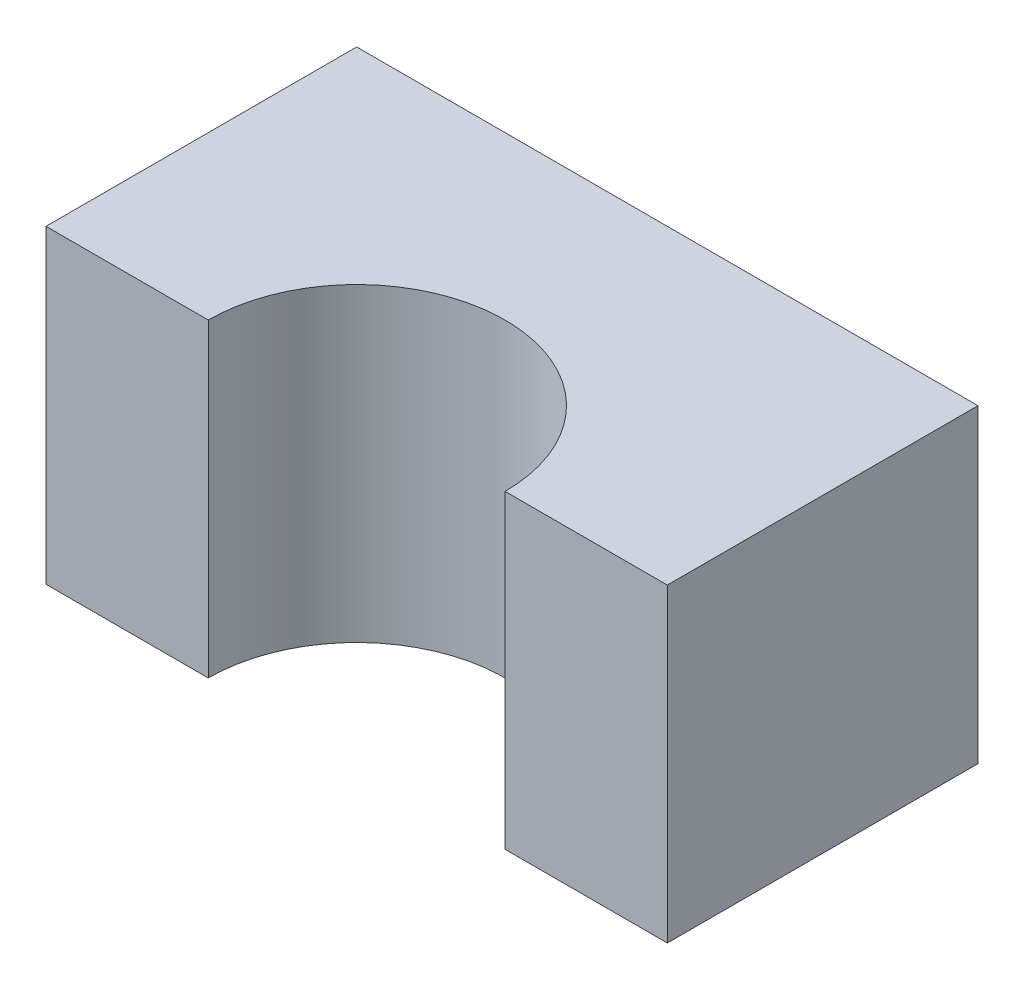
ISO-10303-21;
HEADER;
FILE_DESCRIPTION(('STEP AP214'),'2;1');
FILE_NAME('part.step','',(''),(''),'','','');
FILE_SCHEMA(('AUTOMOTIVE_DESIGN { 1 0 10303 214 1 1 1 1 }'));
ENDSEC;
DATA;
#1=APPLICATION_CONTEXT('core data for automotive mechanical design processes');
#2=APPLICATION_PROTOCOL_DEFINITION('international standard','automotive_design',2000,#1);
#3=PRODUCT_CONTEXT('',#1,'mechanical');
#4=PRODUCT('Part','Part','',(#3));
#5=PRODUCT_RELATED_PRODUCT_CATEGORY('part','',(#4));
#6=PRODUCT_DEFINITION_FORMATION('','',#4);
#7=PRODUCT_DEFINITION_CONTEXT('part definition',#1,'design');
#8=PRODUCT_DEFINITION('design','',#6,#7);
#9=PRODUCT_DEFINITION_SHAPE('','',#8);
#10=(LENGTH_UNIT() NAMED_UNIT(*) SI_UNIT(.MILLI.,.METRE.));
#11=(NAMED_UNIT(*) PLANE_ANGLE_UNIT() SI_UNIT($,.RADIAN.));
#12=(NAMED_UNIT(*) SI_UNIT($,.STERADIAN.) SOLID_ANGLE_UNIT());
#13=UNCERTAINTY_MEASURE_WITH_UNIT(LENGTH_MEASURE(1.E-05),#10,'distance_accuracy_value','');
#14=(GEOMETRIC_REPRESENTATION_CONTEXT(3) GLOBAL_UNCERTAINTY_ASSIGNED_CONTEXT((#13)) GLOBAL_UNIT_ASSIGNED_CONTEXT((#10,
#11,#12)) REPRESENTATION_CONTEXT('',''));
#15=CARTESIAN_POINT('',(0.,0.,0.));
#16=DIRECTION('',(0.,0.,1.));
#17=DIRECTION('',(1.,0.,0.));
#18=AXIS2_PLACEMENT_3D('',#15,#16,#17);
#19=CARTESIAN_POINT('',(0.,0.,0.));
#20=DIRECTION('',(0.,0.,1.));
#21=DIRECTION('',(1.,0.,0.));
#22=AXIS2_PLACEMENT_3D('',#19,#20,#21);
#23=PLANE('',#22);
#24=DIRECTION('',(0.,1.,0.));
#25=VECTOR('',#24,1.);
#26=CARTESIAN_POINT('',(19.05,-19.8975467775468,0.));
#27=LINE('',#26,#25);
#28=CARTESIAN_POINT('',(19.05,-19.8975467775468,0.));
#29=VERTEX_POINT('',#28);
#30=CARTESIAN_POINT('',(19.05,19.8975467775468,0.));
#31=VERTEX_POINT('',#30);
#32=EDGE_CURVE('E11',#29,#31,#27,.T.);
#33=ORIENTED_EDGE('',*,*,#32,.F.);
#34=DIRECTION('',(1.,0.,0.));
#35=VECTOR('',#34,1.);
#36=CARTESIAN_POINT('',(-39.878,-19.8975467775468,0.));
#37=LINE('',#36,#35);
#38=CARTESIAN_POINT('',(39.878,-19.8975467775468,0.));
#39=VERTEX_POINT('',#38);
#40=EDGE_CURVE('E86',#29,#39,#37,.T.);
#41=ORIENTED_EDGE('',*,*,#40,.T.);
#42=DIRECTION('',(0.,1.,0.));
#43=VECTOR('',#42,1.);
#44=CARTESIAN_POINT('',(39.878,19.8975467775468,0.));
#45=LINE('',#44,#43);
#46=CARTESIAN_POINT('',(39.878,19.8975467775468,0.));
#47=VERTEX_POINT('',#46);
#48=EDGE_CURVE('E112',#39,#47,#45,.T.);
#49=ORIENTED_EDGE('',*,*,#48,.T.);
#50=DIRECTION('',(-1.,0.,0.));
#51=VECTOR('',#50,1.);
#52=CARTESIAN_POINT('',(-39.878,19.8975467775468,0.));
#53=LINE('',#52,#51);
#54=EDGE_CURVE('E107',#47,#31,#53,.T.);
#55=ORIENTED_EDGE('',*,*,#54,.T.);
#56=EDGE_LOOP('',(#33,#41,#49,#55));
#57=FACE_BOUND('',#56,.T.);
#58=ADVANCED_FACE('F39',(#57),#23,.T.);
#59=CARTESIAN_POINT('',(39.878,19.8975467775468,-39.878));
#60=DIRECTION('',(1.,0.,0.));
#61=DIRECTION('',(0.,0.,-1.));
#62=AXIS2_PLACEMENT_3D('',#59,#60,#61);
#63=PLANE('',#62);
#64=ORIENTED_EDGE('',*,*,#48,.F.);
#65=DIRECTION('',(0.,0.,1.));
#66=VECTOR('',#65,1.);
#67=CARTESIAN_POINT('',(39.878,-19.8975467775468,-39.878));
#68=LINE('',#67,#66);
#69=CARTESIAN_POINT('',(39.878,-19.8975467775468,-39.878));
#70=VERTEX_POINT('',#69);
#71=EDGE_CURVE('E63',#70,#39,#68,.T.);
#72=ORIENTED_EDGE('',*,*,#71,.F.);
#73=DIRECTION('',(0.,1.,0.));
#74=VECTOR('',#73,1.);
#75=CARTESIAN_POINT('',(39.878,19.8975467775468,-39.878));
#76=LINE('',#75,#74);
#77=CARTESIAN_POINT('',(39.878,19.8975467775468,-39.878));
#78=VERTEX_POINT('',#77);
#79=EDGE_CURVE('E127',#70,#78,#76,.T.);
#80=ORIENTED_EDGE('',*,*,#79,.T.);
#81=DIRECTION('',(0.,0.,1.));
#82=VECTOR('',#81,1.);
#83=CARTESIAN_POINT('',(39.878,19.8975467775468,-39.878));
#84=LINE('',#83,#82);
#85=EDGE_CURVE('E92',#78,#47,#84,.T.);
#86=ORIENTED_EDGE('',*,*,#85,.T.);
#87=EDGE_LOOP('',(#64,#72,#80,#86));
#88=FACE_BOUND('',#87,.T.);
#89=ADVANCED_FACE('F41',(#88),#63,.T.);
#90=CARTESIAN_POINT('',(-39.878,-19.8975467775468,-39.878));
#91=DIRECTION('',(0.,-1.,0.));
#92=DIRECTION('',(0.,0.,-1.));
#93=AXIS2_PLACEMENT_3D('',#90,#91,#92);
#94=PLANE('',#93);
#95=CARTESIAN_POINT('',(0.,-19.8975467775468,0.));
#96=DIRECTION('',(0.,1.,0.));
#97=DIRECTION('',(0.,0.,1.));
#98=AXIS2_PLACEMENT_3D('',#95,#96,#97);
#99=CIRCLE('',#98,19.05);
#100=CARTESIAN_POINT('',(-19.05,-19.8975467775468,0.));
#101=VERTEX_POINT('',#100);
#102=EDGE_CURVE('E103',#29,#101,#99,.T.);
#103=ORIENTED_EDGE('',*,*,#102,.T.);
#104=CARTESIAN_POINT('',(-39.878,-19.8975467775468,0.));
#105=VERTEX_POINT('',#104);
#106=EDGE_CURVE('E123',#105,#101,#37,.T.);
#107=ORIENTED_EDGE('',*,*,#106,.F.);
#108=DIRECTION('',(0.,0.,1.));
#109=VECTOR('',#108,1.);
#110=CARTESIAN_POINT('',(-39.878,-19.8975467775468,-39.878));
#111=LINE('',#110,#109);
#112=CARTESIAN_POINT('',(-39.878,-19.8975467775468,-39.878));
#113=VERTEX_POINT('',#112);
#114=EDGE_CURVE('E130',#113,#105,#111,.T.);
#115=ORIENTED_EDGE('',*,*,#114,.F.);
#116=DIRECTION('',(1.,0.,0.));
#117=VECTOR('',#116,1.);
#118=CARTESIAN_POINT('',(-39.878,-19.8975467775468,-39.878));
#119=LINE('',#118,#117);
#120=EDGE_CURVE('E137',#113,#70,#119,.T.);
#121=ORIENTED_EDGE('',*,*,#120,.T.);
#122=ORIENTED_EDGE('',*,*,#71,.T.);
#123=ORIENTED_EDGE('',*,*,#40,.F.);
#124=EDGE_LOOP('',(#103,#107,#115,#121,#122,#123));
#125=FACE_BOUND('',#124,.T.);
#126=ADVANCED_FACE('F142',(#125),#94,.T.);
#127=CARTESIAN_POINT('',(-39.878,19.8975467775468,-39.878));
#128=DIRECTION('',(-1.,0.,0.));
#129=DIRECTION('',(0.,0.,1.));
#130=AXIS2_PLACEMENT_3D('',#127,#128,#129);
#131=PLANE('',#130);
#132=DIRECTION('',(0.,-1.,0.));
#133=VECTOR('',#132,1.);
#134=CARTESIAN_POINT('',(-39.878,19.8975467775468,0.));
#135=LINE('',#134,#133);
#136=CARTESIAN_POINT('',(-39.878,19.8975467775468,0.));
#137=VERTEX_POINT('',#136);
#138=EDGE_CURVE('E114',#137,#105,#135,.T.);
#139=ORIENTED_EDGE('',*,*,#138,.F.);
#140=DIRECTION('',(0.,0.,1.));
#141=VECTOR('',#140,1.);
#142=CARTESIAN_POINT('',(-39.878,19.8975467775468,-39.878));
#143=LINE('',#142,#141);
#144=CARTESIAN_POINT('',(-39.878,19.8975467775468,-39.878));
#145=VERTEX_POINT('',#144);
#146=EDGE_CURVE('E133',#145,#137,#143,.T.);
#147=ORIENTED_EDGE('',*,*,#146,.F.);
#148=DIRECTION('',(0.,-1.,0.));
#149=VECTOR('',#148,1.);
#150=CARTESIAN_POINT('',(-39.878,19.8975467775468,-39.878));
#151=LINE('',#150,#149);
#152=EDGE_CURVE('E151',#145,#113,#151,.T.);
#153=ORIENTED_EDGE('',*,*,#152,.T.);
#154=ORIENTED_EDGE('',*,*,#114,.T.);
#155=EDGE_LOOP('',(#139,#147,#153,#154));
#156=FACE_BOUND('',#155,.T.);
#157=ADVANCED_FACE('F148',(#156),#131,.T.);
#158=CARTESIAN_POINT('',(-39.878,19.8975467775468,-39.878));
#159=DIRECTION('',(0.,1.,0.));
#160=DIRECTION('',(0.,0.,1.));
#161=AXIS2_PLACEMENT_3D('',#158,#159,#160);
#162=PLANE('',#161);
#163=CARTESIAN_POINT('',(0.,19.8975467775468,0.));
#164=DIRECTION('',(0.,1.,0.));
#165=DIRECTION('',(0.,0.,1.));
#166=AXIS2_PLACEMENT_3D('',#163,#164,#165);
#167=CIRCLE('',#166,19.05);
#168=CARTESIAN_POINT('',(-19.05,19.8975467775468,0.));
#169=VERTEX_POINT('',#168);
#170=EDGE_CURVE('E54',#31,#169,#167,.T.);
#171=ORIENTED_EDGE('',*,*,#170,.F.);
#172=ORIENTED_EDGE('',*,*,#54,.F.);
#173=ORIENTED_EDGE('',*,*,#85,.F.);
#174=DIRECTION('',(-1.,0.,0.));
#175=VECTOR('',#174,1.);
#176=CARTESIAN_POINT('',(-39.878,19.8975467775468,-39.878));
#177=LINE('',#176,#175);
#178=EDGE_CURVE('E157',#78,#145,#177,.T.);
#179=ORIENTED_EDGE('',*,*,#178,.T.);
#180=ORIENTED_EDGE('',*,*,#146,.T.);
#181=EDGE_CURVE('E109',#169,#137,#53,.T.);
#182=ORIENTED_EDGE('',*,*,#181,.F.);
#183=EDGE_LOOP('',(#171,#172,#173,#179,#180,#182));
#184=FACE_BOUND('',#183,.T.);
#185=ADVANCED_FACE('F106',(#184),#162,.T.);
#186=CARTESIAN_POINT('',(0.,0.,-39.878));
#187=DIRECTION('',(0.,0.,1.));
#188=DIRECTION('',(1.,0.,0.));
#189=AXIS2_PLACEMENT_3D('',#186,#187,#188);
#190=PLANE('',#189);
#191=ORIENTED_EDGE('',*,*,#79,.F.);
#192=ORIENTED_EDGE('',*,*,#120,.F.);
#193=ORIENTED_EDGE('',*,*,#152,.F.);
#194=ORIENTED_EDGE('',*,*,#178,.F.);
#195=EDGE_LOOP('',(#191,#192,#193,#194));
#196=FACE_BOUND('',#195,.T.);
#197=ADVANCED_FACE('F163',(#196),#190,.F.);
#198=DIRECTION('',(0.,1.,0.));
#199=VECTOR('',#198,1.);
#200=CARTESIAN_POINT('',(-19.05,-19.8975467775468,0.));
#201=LINE('',#200,#199);
#202=EDGE_CURVE('E48',#169,#101,#201,.F.);
#203=ORIENTED_EDGE('',*,*,#202,.F.);
#204=ORIENTED_EDGE('',*,*,#181,.T.);
#205=ORIENTED_EDGE('',*,*,#138,.T.);
#206=ORIENTED_EDGE('',*,*,#106,.T.);
#207=EDGE_LOOP('',(#203,#204,#205,#206));
#208=FACE_BOUND('',#207,.T.);
#209=ADVANCED_FACE('F145',(#208),#23,.T.);
#210=CARTESIAN_POINT('',(0.,-19.8975467775468,0.));
#211=DIRECTION('',(0.,1.,0.));
#212=DIRECTION('',(0.,0.,1.));
#213=AXIS2_PLACEMENT_3D('',#210,#211,#212);
#214=CYLINDRICAL_SURFACE('',#213,19.05);
#215=ORIENTED_EDGE('',*,*,#32,.T.);
#216=ORIENTED_EDGE('',*,*,#170,.T.);
#217=ORIENTED_EDGE('',*,*,#202,.T.);
#218=ORIENTED_EDGE('',*,*,#102,.F.);
#219=EDGE_LOOP('',(#215,#216,#217,#218));
#220=FACE_BOUND('',#219,.T.);
#221=ADVANCED_FACE('F101',(#220),#214,.F.);
#222=CLOSED_SHELL('',(#58,#89,#126,#157,#185,#197,#209,#221));
#223=MANIFOLD_SOLID_BREP('B2',#222);
#224=ADVANCED_BREP_SHAPE_REPRESENTATION('',(#18,#223),#14);
#225=SHAPE_DEFINITION_REPRESENTATION(#9,#224);
ENDSEC;
END-ISO-10303-21;
